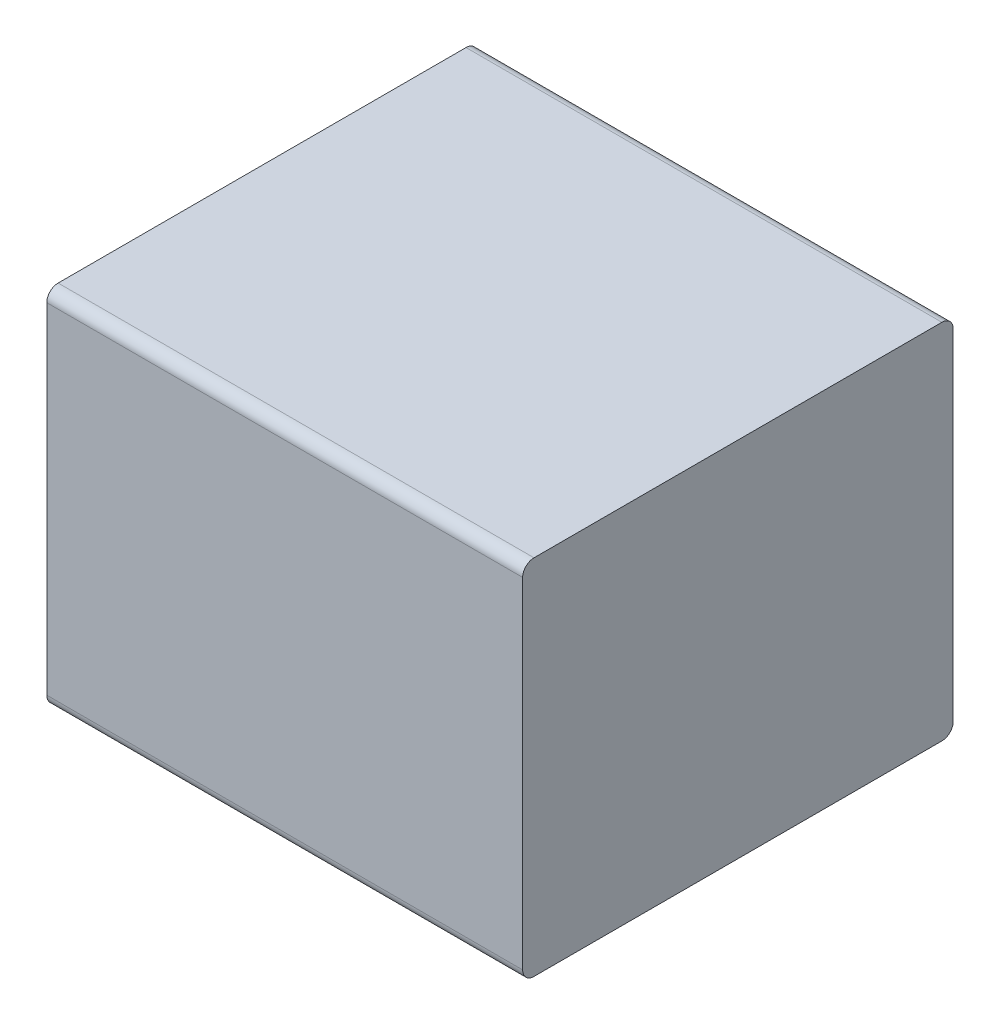
ISO-10303-21;
HEADER;
FILE_DESCRIPTION(('STEP AP214'),'2;1');
FILE_NAME('part.step','',(''),(''),'','','');
FILE_SCHEMA(('AUTOMOTIVE_DESIGN { 1 0 10303 214 1 1 1 1 }'));
ENDSEC;
DATA;
#1=APPLICATION_CONTEXT('core data for automotive mechanical design processes');
#2=APPLICATION_PROTOCOL_DEFINITION('international standard','automotive_design',2000,#1);
#3=PRODUCT_CONTEXT('',#1,'mechanical');
#4=PRODUCT('Part','Part','',(#3));
#5=PRODUCT_RELATED_PRODUCT_CATEGORY('part','',(#4));
#6=PRODUCT_DEFINITION_FORMATION('','',#4);
#7=PRODUCT_DEFINITION_CONTEXT('part definition',#1,'design');
#8=PRODUCT_DEFINITION('design','',#6,#7);
#9=PRODUCT_DEFINITION_SHAPE('','',#8);
#10=(LENGTH_UNIT() NAMED_UNIT(*) SI_UNIT(.MILLI.,.METRE.));
#11=(NAMED_UNIT(*) PLANE_ANGLE_UNIT() SI_UNIT($,.RADIAN.));
#12=(NAMED_UNIT(*) SI_UNIT($,.STERADIAN.) SOLID_ANGLE_UNIT());
#13=UNCERTAINTY_MEASURE_WITH_UNIT(LENGTH_MEASURE(1.E-05),#10,'distance_accuracy_value','');
#14=(GEOMETRIC_REPRESENTATION_CONTEXT(3) GLOBAL_UNCERTAINTY_ASSIGNED_CONTEXT((#13)) GLOBAL_UNIT_ASSIGNED_CONTEXT((#10,
#11,#12)) REPRESENTATION_CONTEXT('',''));
#15=CARTESIAN_POINT('',(0.,0.,0.));
#16=DIRECTION('',(0.,0.,1.));
#17=DIRECTION('',(1.,0.,0.));
#18=AXIS2_PLACEMENT_3D('',#15,#16,#17);
#19=CARTESIAN_POINT('',(0.525,0.75,0.05));
#20=DIRECTION('',(1.,0.,0.));
#21=DIRECTION('',(0.,0.707106781186548,-0.707106781186547));
#22=AXIS2_PLACEMENT_3D('',#19,#20,#21);
#23=CYLINDRICAL_SURFACE('',#22,0.05);
#24=CARTESIAN_POINT('',(1.05,0.75,0.05));
#25=DIRECTION('',(-1.,0.,0.));
#26=DIRECTION('',(0.,0.707106781186548,-0.707106781186547));
#27=AXIS2_PLACEMENT_3D('',#24,#25,#26);
#28=CIRCLE('',#27,0.05);
#29=CARTESIAN_POINT('',(1.05,0.8,0.05));
#30=VERTEX_POINT('',#29);
#31=CARTESIAN_POINT('',(1.05,0.75,0.));
#32=VERTEX_POINT('',#31);
#33=EDGE_CURVE('E11',#30,#32,#28,.T.);
#34=ORIENTED_EDGE('',*,*,#33,.T.);
#35=DIRECTION('',(-1.,0.,0.));
#36=VECTOR('',#35,1.);
#37=CARTESIAN_POINT('',(0.525,0.75,0.));
#38=LINE('',#37,#36);
#39=CARTESIAN_POINT('',(-1.05,0.75,0.));
#40=VERTEX_POINT('',#39);
#41=EDGE_CURVE('E24',#32,#40,#38,.T.);
#42=ORIENTED_EDGE('',*,*,#41,.T.);
#43=CARTESIAN_POINT('',(-1.05,0.75,0.05));
#44=DIRECTION('',(1.,0.,0.));
#45=DIRECTION('',(0.,0.707106781186548,-0.707106781186547));
#46=AXIS2_PLACEMENT_3D('',#43,#44,#45);
#47=CIRCLE('',#46,0.05);
#48=CARTESIAN_POINT('',(-1.05,0.8,0.05));
#49=VERTEX_POINT('',#48);
#50=EDGE_CURVE('E142',#40,#49,#47,.T.);
#51=ORIENTED_EDGE('',*,*,#50,.T.);
#52=DIRECTION('',(1.,0.,0.));
#53=VECTOR('',#52,1.);
#54=CARTESIAN_POINT('',(0.525,0.8,0.05));
#55=LINE('',#54,#53);
#56=EDGE_CURVE('E140',#49,#30,#55,.T.);
#57=ORIENTED_EDGE('',*,*,#56,.T.);
#58=EDGE_LOOP('',(#34,#42,#51,#57));
#59=FACE_BOUND('',#58,.T.);
#60=ADVANCED_FACE('F17',(#59),#23,.T.);
#61=CARTESIAN_POINT('',(1.05,0.8,0.));
#62=DIRECTION('',(0.,1.,0.));
#63=DIRECTION('',(-1.,0.,0.));
#64=AXIS2_PLACEMENT_3D('',#61,#62,#63);
#65=PLANE('',#64);
#66=ORIENTED_EDGE('',*,*,#56,.F.);
#67=DIRECTION('',(0.,0.,1.));
#68=VECTOR('',#67,1.);
#69=CARTESIAN_POINT('',(-1.05,0.8,0.));
#70=LINE('',#69,#68);
#71=CARTESIAN_POINT('',(-1.05,0.8,1.85));
#72=VERTEX_POINT('',#71);
#73=EDGE_CURVE('E138',#49,#72,#70,.T.);
#74=ORIENTED_EDGE('',*,*,#73,.T.);
#75=DIRECTION('',(-1.,0.,0.));
#76=VECTOR('',#75,1.);
#77=CARTESIAN_POINT('',(0.525,0.8,1.85));
#78=LINE('',#77,#76);
#79=CARTESIAN_POINT('',(1.05,0.8,1.85));
#80=VERTEX_POINT('',#79);
#81=EDGE_CURVE('E135',#80,#72,#78,.T.);
#82=ORIENTED_EDGE('',*,*,#81,.F.);
#83=DIRECTION('',(0.,0.,1.));
#84=VECTOR('',#83,1.);
#85=CARTESIAN_POINT('',(1.05,0.8,0.));
#86=LINE('',#85,#84);
#87=EDGE_CURVE('E133',#30,#80,#86,.T.);
#88=ORIENTED_EDGE('',*,*,#87,.F.);
#89=EDGE_LOOP('',(#66,#74,#82,#88));
#90=FACE_BOUND('',#89,.T.);
#91=ADVANCED_FACE('F163',(#90),#65,.T.);
#92=CARTESIAN_POINT('',(-1.05,0.8,0.));
#93=DIRECTION('',(-1.,0.,0.));
#94=DIRECTION('',(0.,-1.,0.));
#95=AXIS2_PLACEMENT_3D('',#92,#93,#94);
#96=PLANE('',#95);
#97=ORIENTED_EDGE('',*,*,#50,.F.);
#98=DIRECTION('',(0.,1.,0.));
#99=VECTOR('',#98,1.);
#100=CARTESIAN_POINT('',(-1.05,-0.8,0.));
#101=LINE('',#100,#99);
#102=CARTESIAN_POINT('',(-1.05,-0.75,0.));
#103=VERTEX_POINT('',#102);
#104=EDGE_CURVE('E130',#103,#40,#101,.T.);
#105=ORIENTED_EDGE('',*,*,#104,.F.);
#106=CARTESIAN_POINT('',(-1.05,-0.75,0.05));
#107=DIRECTION('',(1.,0.,0.));
#108=DIRECTION('',(0.,-0.707106781186548,-0.707106781186547));
#109=AXIS2_PLACEMENT_3D('',#106,#107,#108);
#110=CIRCLE('',#109,0.05);
#111=CARTESIAN_POINT('',(-1.05,-0.8,0.05));
#112=VERTEX_POINT('',#111);
#113=EDGE_CURVE('E127',#112,#103,#110,.T.);
#114=ORIENTED_EDGE('',*,*,#113,.F.);
#115=DIRECTION('',(0.,0.,1.));
#116=VECTOR('',#115,1.);
#117=CARTESIAN_POINT('',(-1.05,-0.8,0.));
#118=LINE('',#117,#116);
#119=CARTESIAN_POINT('',(-1.05,-0.8,1.85));
#120=VERTEX_POINT('',#119);
#121=EDGE_CURVE('E125',#112,#120,#118,.T.);
#122=ORIENTED_EDGE('',*,*,#121,.T.);
#123=CARTESIAN_POINT('',(-1.05,-0.75,1.85));
#124=DIRECTION('',(1.,0.,0.));
#125=DIRECTION('',(0.,-0.707106781186548,0.707106781186548));
#126=AXIS2_PLACEMENT_3D('',#123,#124,#125);
#127=CIRCLE('',#126,0.05);
#128=CARTESIAN_POINT('',(-1.05,-0.75,1.9));
#129=VERTEX_POINT('',#128);
#130=EDGE_CURVE('E123',#129,#120,#127,.T.);
#131=ORIENTED_EDGE('',*,*,#130,.F.);
#132=DIRECTION('',(0.,-1.,0.));
#133=VECTOR('',#132,1.);
#134=CARTESIAN_POINT('',(-1.05,-0.8,1.9));
#135=LINE('',#134,#133);
#136=CARTESIAN_POINT('',(-1.05,0.75,1.9));
#137=VERTEX_POINT('',#136);
#138=EDGE_CURVE('E101',#137,#129,#135,.T.);
#139=ORIENTED_EDGE('',*,*,#138,.F.);
#140=CARTESIAN_POINT('',(-1.05,0.75,1.85));
#141=DIRECTION('',(1.,0.,0.));
#142=DIRECTION('',(0.,0.707106781186548,0.707106781186548));
#143=AXIS2_PLACEMENT_3D('',#140,#141,#142);
#144=CIRCLE('',#143,0.05);
#145=EDGE_CURVE('E119',#72,#137,#144,.T.);
#146=ORIENTED_EDGE('',*,*,#145,.F.);
#147=ORIENTED_EDGE('',*,*,#73,.F.);
#148=EDGE_LOOP('',(#97,#105,#114,#122,#131,#139,#146,#147));
#149=FACE_BOUND('',#148,.T.);
#150=ADVANCED_FACE('F148',(#149),#96,.T.);
#151=CARTESIAN_POINT('',(-0.525,-0.75,0.05));
#152=DIRECTION('',(-1.,0.,0.));
#153=DIRECTION('',(0.,-0.707106781186548,-0.707106781186547));
#154=AXIS2_PLACEMENT_3D('',#151,#152,#153);
#155=CYLINDRICAL_SURFACE('',#154,0.05);
#156=ORIENTED_EDGE('',*,*,#113,.T.);
#157=DIRECTION('',(1.,0.,0.));
#158=VECTOR('',#157,1.);
#159=CARTESIAN_POINT('',(-0.525,-0.75,0.));
#160=LINE('',#159,#158);
#161=CARTESIAN_POINT('',(1.05,-0.75,0.));
#162=VERTEX_POINT('',#161);
#163=EDGE_CURVE('E117',#103,#162,#160,.T.);
#164=ORIENTED_EDGE('',*,*,#163,.T.);
#165=CARTESIAN_POINT('',(1.05,-0.75,0.05));
#166=DIRECTION('',(-1.,0.,0.));
#167=DIRECTION('',(0.,-0.707106781186548,-0.707106781186547));
#168=AXIS2_PLACEMENT_3D('',#165,#166,#167);
#169=CIRCLE('',#168,0.05);
#170=CARTESIAN_POINT('',(1.05,-0.8,0.05));
#171=VERTEX_POINT('',#170);
#172=EDGE_CURVE('E115',#162,#171,#169,.T.);
#173=ORIENTED_EDGE('',*,*,#172,.T.);
#174=DIRECTION('',(-1.,0.,0.));
#175=VECTOR('',#174,1.);
#176=CARTESIAN_POINT('',(-0.525,-0.8,0.05));
#177=LINE('',#176,#175);
#178=EDGE_CURVE('E112',#171,#112,#177,.T.);
#179=ORIENTED_EDGE('',*,*,#178,.T.);
#180=EDGE_LOOP('',(#156,#164,#173,#179));
#181=FACE_BOUND('',#180,.T.);
#182=ADVANCED_FACE('F154',(#181),#155,.T.);
#183=CARTESIAN_POINT('',(-1.05,-0.8,0.));
#184=DIRECTION('',(0.,-1.,0.));
#185=DIRECTION('',(1.,0.,0.));
#186=AXIS2_PLACEMENT_3D('',#183,#184,#185);
#187=PLANE('',#186);
#188=ORIENTED_EDGE('',*,*,#178,.F.);
#189=DIRECTION('',(0.,0.,1.));
#190=VECTOR('',#189,1.);
#191=CARTESIAN_POINT('',(1.05,-0.8,0.));
#192=LINE('',#191,#190);
#193=CARTESIAN_POINT('',(1.05,-0.8,1.85));
#194=VERTEX_POINT('',#193);
#195=EDGE_CURVE('E110',#171,#194,#192,.T.);
#196=ORIENTED_EDGE('',*,*,#195,.T.);
#197=DIRECTION('',(1.,0.,0.));
#198=VECTOR('',#197,1.);
#199=CARTESIAN_POINT('',(-0.525,-0.8,1.85));
#200=LINE('',#199,#198);
#201=EDGE_CURVE('E96',#120,#194,#200,.T.);
#202=ORIENTED_EDGE('',*,*,#201,.F.);
#203=ORIENTED_EDGE('',*,*,#121,.F.);
#204=EDGE_LOOP('',(#188,#196,#202,#203));
#205=FACE_BOUND('',#204,.T.);
#206=ADVANCED_FACE('F157',(#205),#187,.T.);
#207=CARTESIAN_POINT('',(1.05,-0.8,0.));
#208=DIRECTION('',(1.,0.,0.));
#209=DIRECTION('',(0.,1.,0.));
#210=AXIS2_PLACEMENT_3D('',#207,#208,#209);
#211=PLANE('',#210);
#212=ORIENTED_EDGE('',*,*,#33,.F.);
#213=ORIENTED_EDGE('',*,*,#87,.T.);
#214=CARTESIAN_POINT('',(1.05,0.75,1.85));
#215=DIRECTION('',(-1.,0.,0.));
#216=DIRECTION('',(0.,0.707106781186548,0.707106781186548));
#217=AXIS2_PLACEMENT_3D('',#214,#215,#216);
#218=CIRCLE('',#217,0.05);
#219=CARTESIAN_POINT('',(1.05,0.75,1.9));
#220=VERTEX_POINT('',#219);
#221=EDGE_CURVE('E83',#220,#80,#218,.T.);
#222=ORIENTED_EDGE('',*,*,#221,.F.);
#223=DIRECTION('',(0.,1.,0.));
#224=VECTOR('',#223,1.);
#225=CARTESIAN_POINT('',(1.05,0.8,1.9));
#226=LINE('',#225,#224);
#227=CARTESIAN_POINT('',(1.05,-0.75,1.9));
#228=VERTEX_POINT('',#227);
#229=EDGE_CURVE('E77',#228,#220,#226,.T.);
#230=ORIENTED_EDGE('',*,*,#229,.F.);
#231=CARTESIAN_POINT('',(1.05,-0.75,1.85));
#232=DIRECTION('',(-1.,0.,0.));
#233=DIRECTION('',(0.,-0.707106781186548,0.707106781186548));
#234=AXIS2_PLACEMENT_3D('',#231,#232,#233);
#235=CIRCLE('',#234,0.05);
#236=EDGE_CURVE('E81',#194,#228,#235,.T.);
#237=ORIENTED_EDGE('',*,*,#236,.F.);
#238=ORIENTED_EDGE('',*,*,#195,.F.);
#239=ORIENTED_EDGE('',*,*,#172,.F.);
#240=DIRECTION('',(0.,-1.,0.));
#241=VECTOR('',#240,1.);
#242=CARTESIAN_POINT('',(1.05,0.8,0.));
#243=LINE('',#242,#241);
#244=EDGE_CURVE('E97',#32,#162,#243,.T.);
#245=ORIENTED_EDGE('',*,*,#244,.F.);
#246=EDGE_LOOP('',(#212,#213,#222,#230,#237,#238,#239,#245));
#247=FACE_BOUND('',#246,.T.);
#248=ADVANCED_FACE('F79',(#247),#211,.T.);
#249=CARTESIAN_POINT('',(0.525,0.75,1.85));
#250=DIRECTION('',(-1.,0.,0.));
#251=DIRECTION('',(0.,0.707106781186548,0.707106781186548));
#252=AXIS2_PLACEMENT_3D('',#249,#250,#251);
#253=CYLINDRICAL_SURFACE('',#252,0.05);
#254=ORIENTED_EDGE('',*,*,#145,.T.);
#255=DIRECTION('',(1.,0.,0.));
#256=VECTOR('',#255,1.);
#257=CARTESIAN_POINT('',(0.525,0.75,1.9));
#258=LINE('',#257,#256);
#259=EDGE_CURVE('E102',#137,#220,#258,.T.);
#260=ORIENTED_EDGE('',*,*,#259,.T.);
#261=ORIENTED_EDGE('',*,*,#221,.T.);
#262=ORIENTED_EDGE('',*,*,#81,.T.);
#263=EDGE_LOOP('',(#254,#260,#261,#262));
#264=FACE_BOUND('',#263,.T.);
#265=ADVANCED_FACE('F160',(#264),#253,.T.);
#266=CARTESIAN_POINT('',(0.,0.,1.9));
#267=DIRECTION('',(0.,0.,1.));
#268=DIRECTION('',(1.,0.,0.));
#269=AXIS2_PLACEMENT_3D('',#266,#267,#268);
#270=PLANE('',#269);
#271=ORIENTED_EDGE('',*,*,#259,.F.);
#272=ORIENTED_EDGE('',*,*,#138,.T.);
#273=DIRECTION('',(-1.,0.,0.));
#274=VECTOR('',#273,1.);
#275=CARTESIAN_POINT('',(-0.525,-0.75,1.9));
#276=LINE('',#275,#274);
#277=EDGE_CURVE('E94',#228,#129,#276,.T.);
#278=ORIENTED_EDGE('',*,*,#277,.F.);
#279=ORIENTED_EDGE('',*,*,#229,.T.);
#280=EDGE_LOOP('',(#271,#272,#278,#279));
#281=FACE_BOUND('',#280,.T.);
#282=ADVANCED_FACE('F100',(#281),#270,.T.);
#283=CARTESIAN_POINT('',(-0.525,-0.75,1.85));
#284=DIRECTION('',(1.,0.,0.));
#285=DIRECTION('',(0.,-0.707106781186548,0.707106781186548));
#286=AXIS2_PLACEMENT_3D('',#283,#284,#285);
#287=CYLINDRICAL_SURFACE('',#286,0.05);
#288=ORIENTED_EDGE('',*,*,#236,.T.);
#289=ORIENTED_EDGE('',*,*,#277,.T.);
#290=ORIENTED_EDGE('',*,*,#130,.T.);
#291=ORIENTED_EDGE('',*,*,#201,.T.);
#292=EDGE_LOOP('',(#288,#289,#290,#291));
#293=FACE_BOUND('',#292,.T.);
#294=ADVANCED_FACE('F92',(#293),#287,.T.);
#295=CARTESIAN_POINT('',(0.,0.,0.));
#296=DIRECTION('',(0.,0.,1.));
#297=DIRECTION('',(1.,0.,0.));
#298=AXIS2_PLACEMENT_3D('',#295,#296,#297);
#299=PLANE('',#298);
#300=ORIENTED_EDGE('',*,*,#41,.F.);
#301=ORIENTED_EDGE('',*,*,#244,.T.);
#302=ORIENTED_EDGE('',*,*,#163,.F.);
#303=ORIENTED_EDGE('',*,*,#104,.T.);
#304=EDGE_LOOP('',(#300,#301,#302,#303));
#305=FACE_BOUND('',#304,.T.);
#306=ADVANCED_FACE('F151',(#305),#299,.F.);
#307=CLOSED_SHELL('',(#60,#91,#150,#182,#206,#248,#265,#282,#294,#306));
#308=MANIFOLD_SOLID_BREP('B1',#307);
#309=ADVANCED_BREP_SHAPE_REPRESENTATION('',(#18,#308),#14);
#310=SHAPE_DEFINITION_REPRESENTATION(#9,#309);
ENDSEC;
END-ISO-10303-21;
